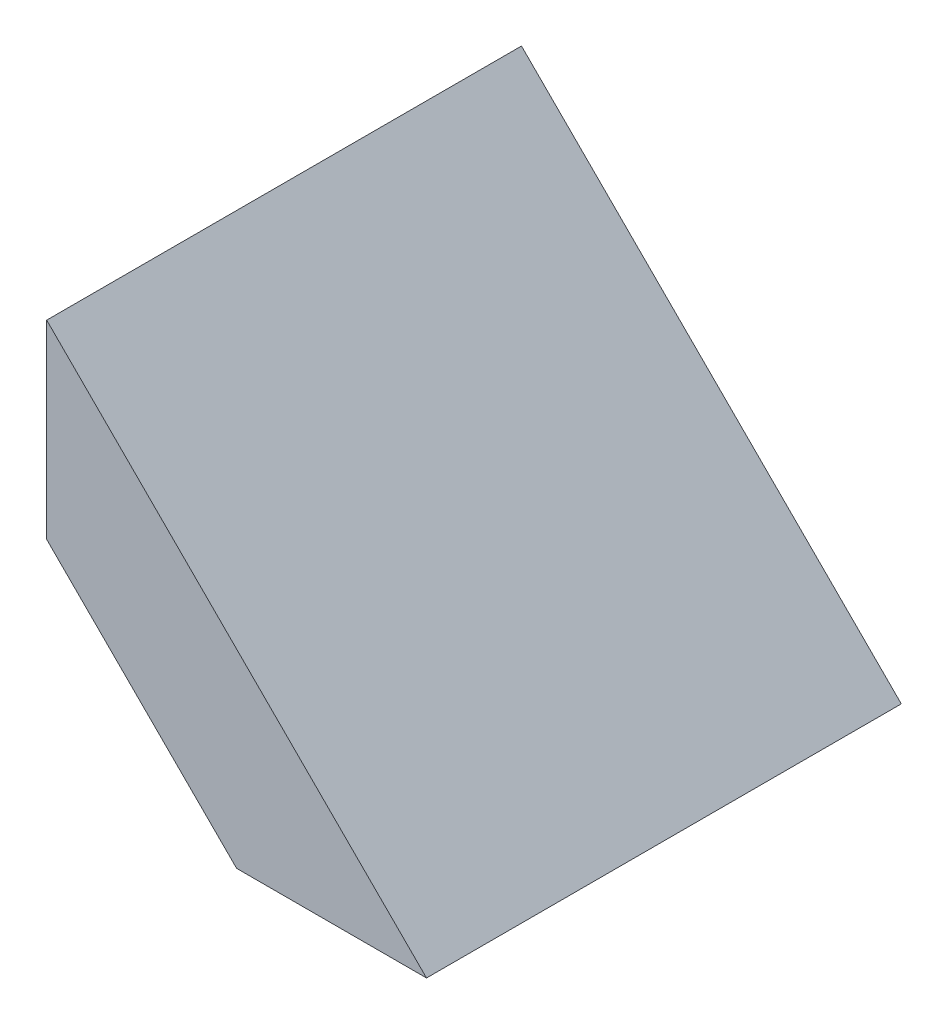
ISO-10303-21;
HEADER;
FILE_DESCRIPTION(('STEP AP214'),'2;1');
FILE_NAME('part.step','',(''),(''),'','','');
FILE_SCHEMA(('AUTOMOTIVE_DESIGN { 1 0 10303 214 1 1 1 1 }'));
ENDSEC;
DATA;
#1=APPLICATION_CONTEXT('core data for automotive mechanical design processes');
#2=APPLICATION_PROTOCOL_DEFINITION('international standard','automotive_design',2000,#1);
#3=PRODUCT_CONTEXT('',#1,'mechanical');
#4=PRODUCT('Part','Part','',(#3));
#5=PRODUCT_RELATED_PRODUCT_CATEGORY('part','',(#4));
#6=PRODUCT_DEFINITION_FORMATION('','',#4);
#7=PRODUCT_DEFINITION_CONTEXT('part definition',#1,'design');
#8=PRODUCT_DEFINITION('design','',#6,#7);
#9=PRODUCT_DEFINITION_SHAPE('','',#8);
#10=(LENGTH_UNIT() NAMED_UNIT(*) SI_UNIT(.MILLI.,.METRE.));
#11=(NAMED_UNIT(*) PLANE_ANGLE_UNIT() SI_UNIT($,.RADIAN.));
#12=(NAMED_UNIT(*) SI_UNIT($,.STERADIAN.) SOLID_ANGLE_UNIT());
#13=UNCERTAINTY_MEASURE_WITH_UNIT(LENGTH_MEASURE(1.E-05),#10,'distance_accuracy_value','');
#14=(GEOMETRIC_REPRESENTATION_CONTEXT(3) GLOBAL_UNCERTAINTY_ASSIGNED_CONTEXT((#13)) GLOBAL_UNIT_ASSIGNED_CONTEXT((#10,
#11,#12)) REPRESENTATION_CONTEXT('',''));
#15=CARTESIAN_POINT('',(0.,0.,0.));
#16=DIRECTION('',(0.,0.,1.));
#17=DIRECTION('',(1.,0.,0.));
#18=AXIS2_PLACEMENT_3D('',#15,#16,#17);
#19=CARTESIAN_POINT('',(-10.,0.,25.));
#20=DIRECTION('',(0.707106781186548,0.707106781186548,0.));
#21=DIRECTION('',(-0.707106781186548,0.707106781186548,0.));
#22=AXIS2_PLACEMENT_3D('',#19,#20,#21);
#23=PLANE('',#22);
#24=DIRECTION('',(0.707106781186548,-0.707106781186548,0.));
#25=VECTOR('',#24,1.);
#26=CARTESIAN_POINT('',(-10.,0.,0.));
#27=LINE('',#26,#25);
#28=CARTESIAN_POINT('',(-20.,10.,0.));
#29=VERTEX_POINT('',#28);
#30=CARTESIAN_POINT('',(-10.,0.,0.));
#31=VERTEX_POINT('',#30);
#32=EDGE_CURVE('E96',#29,#31,#27,.T.);
#33=ORIENTED_EDGE('',*,*,#32,.T.);
#34=DIRECTION('',(0.,0.,-1.));
#35=VECTOR('',#34,1.);
#36=CARTESIAN_POINT('',(-10.,0.,25.));
#37=LINE('',#36,#35);
#38=CARTESIAN_POINT('',(-10.,0.,25.));
#39=VERTEX_POINT('',#38);
#40=EDGE_CURVE('E11',#39,#31,#37,.T.);
#41=ORIENTED_EDGE('',*,*,#40,.F.);
#42=DIRECTION('',(0.707106781186548,-0.707106781186548,0.));
#43=VECTOR('',#42,1.);
#44=CARTESIAN_POINT('',(-10.,0.,25.));
#45=LINE('',#44,#43);
#46=CARTESIAN_POINT('',(-20.,10.,25.));
#47=VERTEX_POINT('',#46);
#48=EDGE_CURVE('E84',#47,#39,#45,.T.);
#49=ORIENTED_EDGE('',*,*,#48,.F.);
#50=DIRECTION('',(0.,0.,-1.));
#51=VECTOR('',#50,1.);
#52=CARTESIAN_POINT('',(-20.,10.,25.));
#53=LINE('',#52,#51);
#54=EDGE_CURVE('E92',#47,#29,#53,.T.);
#55=ORIENTED_EDGE('',*,*,#54,.T.);
#56=EDGE_LOOP('',(#33,#41,#49,#55));
#57=FACE_BOUND('',#56,.T.);
#58=ADVANCED_FACE('F33',(#57),#23,.F.);
#59=CARTESIAN_POINT('',(0.,0.,25.));
#60=DIRECTION('',(0.,1.,0.));
#61=DIRECTION('',(-1.,0.,0.));
#62=AXIS2_PLACEMENT_3D('',#59,#60,#61);
#63=PLANE('',#62);
#64=DIRECTION('',(1.,0.,0.));
#65=VECTOR('',#64,1.);
#66=CARTESIAN_POINT('',(0.,0.,0.));
#67=LINE('',#66,#65);
#68=CARTESIAN_POINT('',(0.,0.,0.));
#69=VERTEX_POINT('',#68);
#70=EDGE_CURVE('E88',#31,#69,#67,.T.);
#71=ORIENTED_EDGE('',*,*,#70,.T.);
#72=DIRECTION('',(0.,0.,-1.));
#73=VECTOR('',#72,1.);
#74=CARTESIAN_POINT('',(0.,0.,25.));
#75=LINE('',#74,#73);
#76=CARTESIAN_POINT('',(0.,0.,25.));
#77=VERTEX_POINT('',#76);
#78=EDGE_CURVE('E41',#77,#69,#75,.T.);
#79=ORIENTED_EDGE('',*,*,#78,.F.);
#80=DIRECTION('',(1.,0.,0.));
#81=VECTOR('',#80,1.);
#82=CARTESIAN_POINT('',(0.,0.,25.));
#83=LINE('',#82,#81);
#84=EDGE_CURVE('E79',#39,#77,#83,.T.);
#85=ORIENTED_EDGE('',*,*,#84,.F.);
#86=ORIENTED_EDGE('',*,*,#40,.T.);
#87=EDGE_LOOP('',(#71,#79,#85,#86));
#88=FACE_BOUND('',#87,.T.);
#89=ADVANCED_FACE('F87',(#88),#63,.F.);
#90=CARTESIAN_POINT('',(-20.,20.,25.));
#91=DIRECTION('',(-0.707106781186548,-0.707106781186548,0.));
#92=DIRECTION('',(0.707106781186548,-0.707106781186548,0.));
#93=AXIS2_PLACEMENT_3D('',#90,#91,#92);
#94=PLANE('',#93);
#95=DIRECTION('',(-0.707106781186548,0.707106781186548,0.));
#96=VECTOR('',#95,1.);
#97=CARTESIAN_POINT('',(-20.,20.,0.));
#98=LINE('',#97,#96);
#99=CARTESIAN_POINT('',(-20.,20.,0.));
#100=VERTEX_POINT('',#99);
#101=EDGE_CURVE('E66',#69,#100,#98,.T.);
#102=ORIENTED_EDGE('',*,*,#101,.T.);
#103=DIRECTION('',(0.,0.,-1.));
#104=VECTOR('',#103,1.);
#105=CARTESIAN_POINT('',(-20.,20.,25.));
#106=LINE('',#105,#104);
#107=CARTESIAN_POINT('',(-20.,20.,25.));
#108=VERTEX_POINT('',#107);
#109=EDGE_CURVE('E89',#108,#100,#106,.T.);
#110=ORIENTED_EDGE('',*,*,#109,.F.);
#111=DIRECTION('',(-0.707106781186548,0.707106781186548,0.));
#112=VECTOR('',#111,1.);
#113=CARTESIAN_POINT('',(-20.,20.,25.));
#114=LINE('',#113,#112);
#115=EDGE_CURVE('E82',#77,#108,#114,.T.);
#116=ORIENTED_EDGE('',*,*,#115,.F.);
#117=ORIENTED_EDGE('',*,*,#78,.T.);
#118=EDGE_LOOP('',(#102,#110,#116,#117));
#119=FACE_BOUND('',#118,.T.);
#120=ADVANCED_FACE('F90',(#119),#94,.F.);
#121=CARTESIAN_POINT('',(-20.,10.,25.));
#122=DIRECTION('',(1.,0.,0.));
#123=DIRECTION('',(0.,0.,-1.));
#124=AXIS2_PLACEMENT_3D('',#121,#122,#123);
#125=PLANE('',#124);
#126=DIRECTION('',(0.,-1.,0.));
#127=VECTOR('',#126,1.);
#128=CARTESIAN_POINT('',(-20.,10.,0.));
#129=LINE('',#128,#127);
#130=EDGE_CURVE('E72',#100,#29,#129,.T.);
#131=ORIENTED_EDGE('',*,*,#130,.T.);
#132=ORIENTED_EDGE('',*,*,#54,.F.);
#133=DIRECTION('',(0.,-1.,0.));
#134=VECTOR('',#133,1.);
#135=CARTESIAN_POINT('',(-20.,10.,25.));
#136=LINE('',#135,#134);
#137=EDGE_CURVE('E49',#108,#47,#136,.T.);
#138=ORIENTED_EDGE('',*,*,#137,.F.);
#139=ORIENTED_EDGE('',*,*,#109,.T.);
#140=EDGE_LOOP('',(#131,#132,#138,#139));
#141=FACE_BOUND('',#140,.T.);
#142=ADVANCED_FACE('F103',(#141),#125,.F.);
#143=CARTESIAN_POINT('',(0.,0.,25.));
#144=DIRECTION('',(0.,0.,-1.));
#145=DIRECTION('',(-1.,0.,0.));
#146=AXIS2_PLACEMENT_3D('',#143,#144,#145);
#147=PLANE('',#146);
#148=ORIENTED_EDGE('',*,*,#48,.T.);
#149=ORIENTED_EDGE('',*,*,#84,.T.);
#150=ORIENTED_EDGE('',*,*,#115,.T.);
#151=ORIENTED_EDGE('',*,*,#137,.T.);
#152=EDGE_LOOP('',(#148,#149,#150,#151));
#153=FACE_BOUND('',#152,.T.);
#154=ADVANCED_FACE('F80',(#153),#147,.F.);
#155=CARTESIAN_POINT('',(0.,0.,0.));
#156=DIRECTION('',(0.,0.,-1.));
#157=DIRECTION('',(-1.,0.,0.));
#158=AXIS2_PLACEMENT_3D('',#155,#156,#157);
#159=PLANE('',#158);
#160=ORIENTED_EDGE('',*,*,#32,.F.);
#161=ORIENTED_EDGE('',*,*,#130,.F.);
#162=ORIENTED_EDGE('',*,*,#101,.F.);
#163=ORIENTED_EDGE('',*,*,#70,.F.);
#164=EDGE_LOOP('',(#160,#161,#162,#163));
#165=FACE_BOUND('',#164,.T.);
#166=ADVANCED_FACE('F106',(#165),#159,.T.);
#167=CLOSED_SHELL('',(#58,#89,#120,#142,#154,#166));
#168=MANIFOLD_SOLID_BREP('B2',#167);
#169=ADVANCED_BREP_SHAPE_REPRESENTATION('',(#18,#168),#14);
#170=SHAPE_DEFINITION_REPRESENTATION(#9,#169);
ENDSEC;
END-ISO-10303-21;
